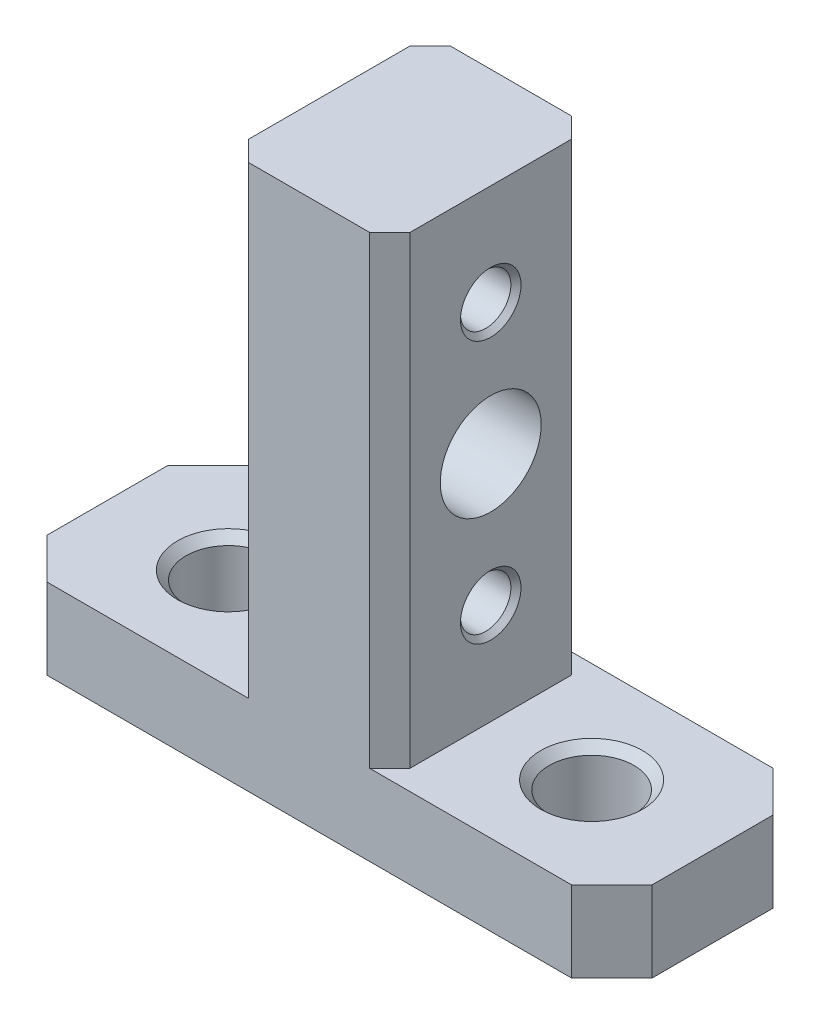
ISO-10303-21;
HEADER;
FILE_DESCRIPTION(('STEP AP214'),'2;1');
FILE_NAME('part.step','',(''),(''),'','','');
FILE_SCHEMA(('AUTOMOTIVE_DESIGN { 1 0 10303 214 1 1 1 1 }'));
ENDSEC;
DATA;
#1=APPLICATION_CONTEXT('core data for automotive mechanical design processes');
#2=APPLICATION_PROTOCOL_DEFINITION('international standard','automotive_design',2000,#1);
#3=PRODUCT_CONTEXT('',#1,'mechanical');
#4=PRODUCT('Part','Part','',(#3));
#5=PRODUCT_RELATED_PRODUCT_CATEGORY('part','',(#4));
#6=PRODUCT_DEFINITION_FORMATION('','',#4);
#7=PRODUCT_DEFINITION_CONTEXT('part definition',#1,'design');
#8=PRODUCT_DEFINITION('design','',#6,#7);
#9=PRODUCT_DEFINITION_SHAPE('','',#8);
#10=(LENGTH_UNIT() NAMED_UNIT(*) SI_UNIT(.MILLI.,.METRE.));
#11=(NAMED_UNIT(*) PLANE_ANGLE_UNIT() SI_UNIT($,.RADIAN.));
#12=(NAMED_UNIT(*) SI_UNIT($,.STERADIAN.) SOLID_ANGLE_UNIT());
#13=UNCERTAINTY_MEASURE_WITH_UNIT(LENGTH_MEASURE(1.E-05),#10,'distance_accuracy_value','');
#14=(GEOMETRIC_REPRESENTATION_CONTEXT(3) GLOBAL_UNCERTAINTY_ASSIGNED_CONTEXT((#13)) GLOBAL_UNIT_ASSIGNED_CONTEXT((#10,
#11,#12)) REPRESENTATION_CONTEXT('',''));
#15=CARTESIAN_POINT('',(0.,0.,0.));
#16=DIRECTION('',(0.,0.,1.));
#17=DIRECTION('',(1.,0.,0.));
#18=AXIS2_PLACEMENT_3D('',#15,#16,#17);
#19=CARTESIAN_POINT('',(-41.5733131157233,-4.03957418193176,10.));
#20=DIRECTION('',(0.,-1.,0.));
#21=DIRECTION('',(0.,0.,-1.));
#22=AXIS2_PLACEMENT_3D('',#19,#20,#21);
#23=PLANE('',#22);
#24=DIRECTION('',(0.,0.,-1.));
#25=VECTOR('',#24,1.);
#26=CARTESIAN_POINT('',(-41.5733131157233,-4.03957418193176,10.));
#27=LINE('',#26,#25);
#28=CARTESIAN_POINT('',(-41.5733131157233,-4.03957418193176,8.));
#29=VERTEX_POINT('',#28);
#30=CARTESIAN_POINT('',(-41.5733131157233,-4.03957418193176,1.99999999999999));
#31=VERTEX_POINT('',#30);
#32=EDGE_CURVE('E159',#29,#31,#27,.T.);
#33=ORIENTED_EDGE('',*,*,#32,.F.);
#34=DIRECTION('',(-0.707106781186546,0.,-0.707106781186549));
#35=VECTOR('',#34,1.);
#36=CARTESIAN_POINT('',(-39.5733131157233,-4.03957418193176,10.));
#37=LINE('',#36,#35);
#38=CARTESIAN_POINT('',(-39.5733131157233,-4.03957418193176,10.));
#39=VERTEX_POINT('',#38);
#40=EDGE_CURVE('E153',#29,#39,#37,.F.);
#41=ORIENTED_EDGE('',*,*,#40,.T.);
#42=DIRECTION('',(-1.,0.,0.));
#43=VECTOR('',#42,1.);
#44=CARTESIAN_POINT('',(-41.5733131157233,-4.03957418193176,10.));
#45=LINE('',#44,#43);
#46=CARTESIAN_POINT('',(-29.5733131157233,-4.03957418193176,10.));
#47=VERTEX_POINT('',#46);
#48=EDGE_CURVE('E156',#47,#39,#45,.T.);
#49=ORIENTED_EDGE('',*,*,#48,.F.);
#50=DIRECTION('',(0.707106781186548,0.,0.707106781186547));
#51=VECTOR('',#50,1.);
#52=CARTESIAN_POINT('',(-35.5733131157233,-4.03957418193176,4.));
#53=LINE('',#52,#51);
#54=CARTESIAN_POINT('',(-30.5733131157233,-4.03957418193176,9.00000000000001));
#55=VERTEX_POINT('',#54);
#56=EDGE_CURVE('E243',#47,#55,#53,.F.);
#57=ORIENTED_EDGE('',*,*,#56,.T.);
#58=DIRECTION('',(0.,0.,-1.));
#59=VECTOR('',#58,1.);
#60=CARTESIAN_POINT('',(-30.5733131157233,-4.03957418193176,10.));
#61=LINE('',#60,#59);
#62=CARTESIAN_POINT('',(-30.5733131157233,-4.03957418193176,1.));
#63=VERTEX_POINT('',#62);
#64=EDGE_CURVE('E248',#55,#63,#61,.T.);
#65=ORIENTED_EDGE('',*,*,#64,.T.);
#66=DIRECTION('',(0.707106781186548,0.,-0.707106781186547));
#67=VECTOR('',#66,1.);
#68=CARTESIAN_POINT('',(-40.5733131157233,-4.03957418193176,11.));
#69=LINE('',#68,#67);
#70=CARTESIAN_POINT('',(-29.5733131157233,-4.03957418193176,0.));
#71=VERTEX_POINT('',#70);
#72=EDGE_CURVE('E49',#63,#71,#69,.T.);
#73=ORIENTED_EDGE('',*,*,#72,.T.);
#74=DIRECTION('',(-1.,0.,0.));
#75=VECTOR('',#74,1.);
#76=CARTESIAN_POINT('',(-41.5733131157233,-4.03957418193176,0.));
#77=LINE('',#76,#75);
#78=CARTESIAN_POINT('',(-39.5733131157233,-4.03957418193176,0.));
#79=VERTEX_POINT('',#78);
#80=EDGE_CURVE('E56',#71,#79,#77,.T.);
#81=ORIENTED_EDGE('',*,*,#80,.T.);
#82=DIRECTION('',(-0.707106781186549,0.,0.707106781186546));
#83=VECTOR('',#82,1.);
#84=CARTESIAN_POINT('',(-41.5733131157233,-4.03957418193176,1.99999999999999));
#85=LINE('',#84,#83);
#86=EDGE_CURVE('E164',#79,#31,#85,.T.);
#87=ORIENTED_EDGE('',*,*,#86,.T.);
#88=EDGE_LOOP('',(#33,#41,#49,#57,#65,#73,#81,#87));
#89=FACE_BOUND('',#88,.T.);
#90=CARTESIAN_POINT('',(-35.5733131157233,-4.03957418193176,5.));
#91=DIRECTION('',(0.,1.,0.));
#92=DIRECTION('',(0.,0.,1.));
#93=AXIS2_PLACEMENT_3D('',#90,#91,#92);
#94=CIRCLE('',#93,2.525);
#95=CARTESIAN_POINT('',(-35.5733131157233,-4.03957418193176,7.525));
#96=VERTEX_POINT('',#95);
#97=EDGE_CURVE('E342',#96,#96,#94,.T.);
#98=ORIENTED_EDGE('',*,*,#97,.F.);
#99=EDGE_LOOP('',(#98));
#100=FACE_BOUND('',#99,.T.);
#101=ADVANCED_FACE('F40',(#89,#100),#23,.F.);
#102=CARTESIAN_POINT('',(-22.5733131157233,-4.03957418193176,10.));
#103=DIRECTION('',(0.,-1.,0.));
#104=DIRECTION('',(0.,0.,-1.));
#105=AXIS2_PLACEMENT_3D('',#102,#103,#104);
#106=PLANE('',#105);
#107=DIRECTION('',(-1.,0.,0.));
#108=VECTOR('',#107,1.);
#109=CARTESIAN_POINT('',(-22.5733131157233,-4.03957418193176,10.));
#110=LINE('',#109,#108);
#111=CARTESIAN_POINT('',(-13.5733131157233,-4.03957418193176,10.));
#112=VERTEX_POINT('',#111);
#113=CARTESIAN_POINT('',(-23.5733131157233,-4.03957418193176,10.));
#114=VERTEX_POINT('',#113);
#115=EDGE_CURVE('E301',#112,#114,#110,.T.);
#116=ORIENTED_EDGE('',*,*,#115,.F.);
#117=DIRECTION('',(-0.707106781186546,0.,0.707106781186549));
#118=VECTOR('',#117,1.);
#119=CARTESIAN_POINT('',(-13.5733131157233,-4.03957418193176,10.));
#120=LINE('',#119,#118);
#121=CARTESIAN_POINT('',(-11.5733131157233,-4.03957418193176,8.));
#122=VERTEX_POINT('',#121);
#123=EDGE_CURVE('E190',#112,#122,#120,.F.);
#124=ORIENTED_EDGE('',*,*,#123,.T.);
#125=DIRECTION('',(0.,0.,-1.));
#126=VECTOR('',#125,1.);
#127=CARTESIAN_POINT('',(-11.5733131157233,-4.03957418193176,10.));
#128=LINE('',#127,#126);
#129=CARTESIAN_POINT('',(-11.5733131157233,-4.03957418193176,2.00000000000001));
#130=VERTEX_POINT('',#129);
#131=EDGE_CURVE('E277',#122,#130,#128,.T.);
#132=ORIENTED_EDGE('',*,*,#131,.T.);
#133=DIRECTION('',(-0.707106781186548,0.,-0.707106781186548));
#134=VECTOR('',#133,1.);
#135=CARTESIAN_POINT('',(-11.5733131157233,-4.03957418193176,2.00000000000001));
#136=LINE('',#135,#134);
#137=CARTESIAN_POINT('',(-13.5733131157233,-4.03957418193176,0.));
#138=VERTEX_POINT('',#137);
#139=EDGE_CURVE('E183',#130,#138,#136,.T.);
#140=ORIENTED_EDGE('',*,*,#139,.T.);
#141=DIRECTION('',(-1.,0.,0.));
#142=VECTOR('',#141,1.);
#143=CARTESIAN_POINT('',(-22.5733131157233,-4.03957418193176,0.));
#144=LINE('',#143,#142);
#145=CARTESIAN_POINT('',(-23.5733131157233,-4.03957418193176,0.));
#146=VERTEX_POINT('',#145);
#147=EDGE_CURVE('E63',#138,#146,#144,.T.);
#148=ORIENTED_EDGE('',*,*,#147,.T.);
#149=DIRECTION('',(0.707106781186549,0.,0.707106781186546));
#150=VECTOR('',#149,1.);
#151=CARTESIAN_POINT('',(-18.0733131157233,-4.03957418193176,5.49999999999999));
#152=LINE('',#151,#150);
#153=CARTESIAN_POINT('',(-22.5733131157233,-4.03957418193176,1.));
#154=VERTEX_POINT('',#153);
#155=EDGE_CURVE('E11',#146,#154,#152,.T.);
#156=ORIENTED_EDGE('',*,*,#155,.T.);
#157=DIRECTION('',(0.,0.,-1.));
#158=VECTOR('',#157,1.);
#159=CARTESIAN_POINT('',(-22.5733131157233,-4.03957418193176,10.));
#160=LINE('',#159,#158);
#161=CARTESIAN_POINT('',(-22.5733131157233,-4.03957418193176,9.));
#162=VERTEX_POINT('',#161);
#163=EDGE_CURVE('E274',#162,#154,#160,.T.);
#164=ORIENTED_EDGE('',*,*,#163,.F.);
#165=DIRECTION('',(0.707106781186548,0.,-0.707106781186548));
#166=VECTOR('',#165,1.);
#167=CARTESIAN_POINT('',(-23.0733131157233,-4.03957418193176,9.5));
#168=LINE('',#167,#166);
#169=EDGE_CURVE('E240',#162,#114,#168,.F.);
#170=ORIENTED_EDGE('',*,*,#169,.T.);
#171=EDGE_LOOP('',(#116,#124,#132,#140,#148,#156,#164,#170));
#172=FACE_BOUND('',#171,.T.);
#173=CARTESIAN_POINT('',(-17.5733131157233,-4.03957418193176,5.));
#174=DIRECTION('',(0.,1.,0.));
#175=DIRECTION('',(0.,0.,1.));
#176=AXIS2_PLACEMENT_3D('',#173,#174,#175);
#177=CIRCLE('',#176,2.525);
#178=CARTESIAN_POINT('',(-17.5733131157233,-4.03957418193176,7.525));
#179=VERTEX_POINT('',#178);
#180=EDGE_CURVE('E333',#179,#179,#177,.T.);
#181=ORIENTED_EDGE('',*,*,#180,.F.);
#182=EDGE_LOOP('',(#181));
#183=FACE_BOUND('',#182,.T.);
#184=ADVANCED_FACE('F348',(#172,#183),#106,.F.);
#185=CARTESIAN_POINT('',(-22.5733131157233,-4.03957418193176,10.));
#186=DIRECTION('',(-1.,0.,0.));
#187=DIRECTION('',(0.,0.,1.));
#188=AXIS2_PLACEMENT_3D('',#185,#186,#187);
#189=PLANE('',#188);
#190=CARTESIAN_POINT('',(-22.5733131157233,7.46042581806824,5.));
#191=DIRECTION('',(1.,0.,0.));
#192=DIRECTION('',(0.,0.,-1.));
#193=AXIS2_PLACEMENT_3D('',#190,#191,#192);
#194=CIRCLE('',#193,2.5);
#195=CARTESIAN_POINT('',(-22.5733131157233,7.46042581806824,2.5));
#196=VERTEX_POINT('',#195);
#197=EDGE_CURVE('E306',#196,#196,#194,.T.);
#198=ORIENTED_EDGE('',*,*,#197,.F.);
#199=EDGE_LOOP('',(#198));
#200=FACE_BOUND('',#199,.T.);
#201=DIRECTION('',(0.,0.,-1.));
#202=VECTOR('',#201,1.);
#203=CARTESIAN_POINT('',(-22.5733131157233,18.9604258180682,10.));
#204=LINE('',#203,#202);
#205=CARTESIAN_POINT('',(-22.5733131157233,18.9604258180682,9.));
#206=VERTEX_POINT('',#205);
#207=CARTESIAN_POINT('',(-22.5733131157233,18.9604258180682,1.));
#208=VERTEX_POINT('',#207);
#209=EDGE_CURVE('E272',#206,#208,#204,.T.);
#210=ORIENTED_EDGE('',*,*,#209,.F.);
#211=DIRECTION('',(0.,-1.,0.));
#212=VECTOR('',#211,1.);
#213=CARTESIAN_POINT('',(-22.5733131157233,-4.03957418193176,9.));
#214=LINE('',#213,#212);
#215=EDGE_CURVE('E229',#206,#162,#214,.T.);
#216=ORIENTED_EDGE('',*,*,#215,.T.);
#217=ORIENTED_EDGE('',*,*,#163,.T.);
#218=DIRECTION('',(0.,1.,0.));
#219=VECTOR('',#218,1.);
#220=CARTESIAN_POINT('',(-22.5733131157233,18.9604258180682,1.));
#221=LINE('',#220,#219);
#222=EDGE_CURVE('E226',#154,#208,#221,.T.);
#223=ORIENTED_EDGE('',*,*,#222,.T.);
#224=EDGE_LOOP('',(#210,#216,#217,#223));
#225=FACE_BOUND('',#224,.T.);
#226=CARTESIAN_POINT('',(-22.5733131157233,0.960425818068242,5.));
#227=DIRECTION('',(1.,0.,0.));
#228=DIRECTION('',(0.,0.,-1.));
#229=AXIS2_PLACEMENT_3D('',#226,#227,#228);
#230=CIRCLE('',#229,1.5);
#231=CARTESIAN_POINT('',(-22.5733131157233,0.960425818068242,3.5));
#232=VERTEX_POINT('',#231);
#233=EDGE_CURVE('E315',#232,#232,#230,.T.);
#234=ORIENTED_EDGE('',*,*,#233,.F.);
#235=EDGE_LOOP('',(#234));
#236=FACE_BOUND('',#235,.T.);
#237=CARTESIAN_POINT('',(-22.5733131157233,13.9604258180682,5.));
#238=DIRECTION('',(1.,0.,0.));
#239=DIRECTION('',(0.,0.,-1.));
#240=AXIS2_PLACEMENT_3D('',#237,#238,#239);
#241=CIRCLE('',#240,1.5);
#242=CARTESIAN_POINT('',(-22.5733131157233,13.9604258180682,3.5));
#243=VERTEX_POINT('',#242);
#244=EDGE_CURVE('E324',#243,#243,#241,.T.);
#245=ORIENTED_EDGE('',*,*,#244,.F.);
#246=EDGE_LOOP('',(#245));
#247=FACE_BOUND('',#246,.T.);
#248=ADVANCED_FACE('F353',(#200,#225,#236,#247),#189,.F.);
#249=CARTESIAN_POINT('',(-41.5733131157233,-4.03957418193176,10.));
#250=DIRECTION('',(1.,0.,0.));
#251=DIRECTION('',(0.,0.,-1.));
#252=AXIS2_PLACEMENT_3D('',#249,#250,#251);
#253=PLANE('',#252);
#254=DIRECTION('',(0.,0.,-1.));
#255=VECTOR('',#254,1.);
#256=CARTESIAN_POINT('',(-41.5733131157233,-8.03957418193176,10.));
#257=LINE('',#256,#255);
#258=CARTESIAN_POINT('',(-41.5733131157233,-8.03957418193176,8.));
#259=VERTEX_POINT('',#258);
#260=CARTESIAN_POINT('',(-41.5733131157233,-8.03957418193176,1.99999999999999));
#261=VERTEX_POINT('',#260);
#262=EDGE_CURVE('E185',#259,#261,#257,.T.);
#263=ORIENTED_EDGE('',*,*,#262,.F.);
#264=DIRECTION('',(0.,1.,0.));
#265=VECTOR('',#264,1.);
#266=CARTESIAN_POINT('',(-41.5733131157233,-4.03957418193176,8.));
#267=LINE('',#266,#265);
#268=EDGE_CURVE('E211',#259,#29,#267,.T.);
#269=ORIENTED_EDGE('',*,*,#268,.T.);
#270=ORIENTED_EDGE('',*,*,#32,.T.);
#271=DIRECTION('',(0.,-1.,0.));
#272=VECTOR('',#271,1.);
#273=CARTESIAN_POINT('',(-41.5733131157233,-8.03957418193176,1.99999999999999));
#274=LINE('',#273,#272);
#275=EDGE_CURVE('E208',#31,#261,#274,.T.);
#276=ORIENTED_EDGE('',*,*,#275,.T.);
#277=EDGE_LOOP('',(#263,#269,#270,#276));
#278=FACE_BOUND('',#277,.T.);
#279=ADVANCED_FACE('F290',(#278),#253,.F.);
#280=CARTESIAN_POINT('',(-41.5733131157233,-8.03957418193176,10.));
#281=DIRECTION('',(0.,1.,0.));
#282=DIRECTION('',(0.,0.,1.));
#283=AXIS2_PLACEMENT_3D('',#280,#281,#282);
#284=PLANE('',#283);
#285=CARTESIAN_POINT('',(-35.5733131157233,-8.03957418193176,5.));
#286=DIRECTION('',(0.,1.,0.));
#287=DIRECTION('',(0.,0.,1.));
#288=AXIS2_PLACEMENT_3D('',#285,#286,#287);
#289=CIRCLE('',#288,2.1);
#290=CARTESIAN_POINT('',(-35.5733131157233,-8.03957418193176,7.1));
#291=VERTEX_POINT('',#290);
#292=EDGE_CURVE('E336',#291,#291,#289,.T.);
#293=ORIENTED_EDGE('',*,*,#292,.T.);
#294=EDGE_LOOP('',(#293));
#295=FACE_BOUND('',#294,.T.);
#296=CARTESIAN_POINT('',(-17.5733131157233,-8.03957418193176,5.));
#297=DIRECTION('',(0.,1.,0.));
#298=DIRECTION('',(0.,0.,1.));
#299=AXIS2_PLACEMENT_3D('',#296,#297,#298);
#300=CIRCLE('',#299,2.1);
#301=CARTESIAN_POINT('',(-17.5733131157233,-8.03957418193176,7.1));
#302=VERTEX_POINT('',#301);
#303=EDGE_CURVE('E327',#302,#302,#300,.T.);
#304=ORIENTED_EDGE('',*,*,#303,.T.);
#305=EDGE_LOOP('',(#304));
#306=FACE_BOUND('',#305,.T.);
#307=DIRECTION('',(0.,0.,-1.));
#308=VECTOR('',#307,1.);
#309=CARTESIAN_POINT('',(-11.5733131157233,-8.03957418193176,10.));
#310=LINE('',#309,#308);
#311=CARTESIAN_POINT('',(-11.5733131157233,-8.03957418193176,8.));
#312=VERTEX_POINT('',#311);
#313=CARTESIAN_POINT('',(-11.5733131157233,-8.03957418193176,2.00000000000001));
#314=VERTEX_POINT('',#313);
#315=EDGE_CURVE('E280',#312,#314,#310,.T.);
#316=ORIENTED_EDGE('',*,*,#315,.F.);
#317=DIRECTION('',(0.707106781186546,0.,-0.707106781186549));
#318=VECTOR('',#317,1.);
#319=CARTESIAN_POINT('',(-13.5733131157233,-8.03957418193176,9.99999999999999));
#320=LINE('',#319,#318);
#321=CARTESIAN_POINT('',(-13.5733131157233,-8.03957418193176,10.));
#322=VERTEX_POINT('',#321);
#323=EDGE_CURVE('E202',#312,#322,#320,.F.);
#324=ORIENTED_EDGE('',*,*,#323,.T.);
#325=DIRECTION('',(1.,0.,0.));
#326=VECTOR('',#325,1.);
#327=CARTESIAN_POINT('',(-41.5733131157233,-8.03957418193176,10.));
#328=LINE('',#327,#326);
#329=CARTESIAN_POINT('',(-39.5733131157233,-8.03957418193176,10.));
#330=VERTEX_POINT('',#329);
#331=EDGE_CURVE('E175',#330,#322,#328,.T.);
#332=ORIENTED_EDGE('',*,*,#331,.F.);
#333=DIRECTION('',(0.707106781186546,0.,0.707106781186549));
#334=VECTOR('',#333,1.);
#335=CARTESIAN_POINT('',(-39.5733131157233,-8.03957418193176,10.));
#336=LINE('',#335,#334);
#337=EDGE_CURVE('E179',#330,#259,#336,.F.);
#338=ORIENTED_EDGE('',*,*,#337,.T.);
#339=ORIENTED_EDGE('',*,*,#262,.T.);
#340=DIRECTION('',(0.707106781186549,0.,-0.707106781186546));
#341=VECTOR('',#340,1.);
#342=CARTESIAN_POINT('',(-41.5733131157233,-8.03957418193176,1.99999999999999));
#343=LINE('',#342,#341);
#344=CARTESIAN_POINT('',(-39.5733131157233,-8.03957418193176,0.));
#345=VERTEX_POINT('',#344);
#346=EDGE_CURVE('E197',#261,#345,#343,.T.);
#347=ORIENTED_EDGE('',*,*,#346,.T.);
#348=DIRECTION('',(1.,0.,0.));
#349=VECTOR('',#348,1.);
#350=CARTESIAN_POINT('',(-41.5733131157233,-8.03957418193176,0.));
#351=LINE('',#350,#349);
#352=CARTESIAN_POINT('',(-13.5733131157233,-8.03957418193176,0.));
#353=VERTEX_POINT('',#352);
#354=EDGE_CURVE('E264',#345,#353,#351,.T.);
#355=ORIENTED_EDGE('',*,*,#354,.T.);
#356=DIRECTION('',(0.707106781186548,0.,0.707106781186548));
#357=VECTOR('',#356,1.);
#358=CARTESIAN_POINT('',(-11.5733131157233,-8.03957418193176,2.00000000000001));
#359=LINE('',#358,#357);
#360=EDGE_CURVE('E200',#353,#314,#359,.T.);
#361=ORIENTED_EDGE('',*,*,#360,.T.);
#362=EDGE_LOOP('',(#316,#324,#332,#338,#339,#347,#355,#361));
#363=FACE_BOUND('',#362,.T.);
#364=ADVANCED_FACE('F286',(#295,#306,#363),#284,.F.);
#365=CARTESIAN_POINT('',(-11.5733131157233,-8.03957418193176,10.));
#366=DIRECTION('',(-1.,0.,0.));
#367=DIRECTION('',(0.,-1.,0.));
#368=AXIS2_PLACEMENT_3D('',#365,#366,#367);
#369=PLANE('',#368);
#370=ORIENTED_EDGE('',*,*,#131,.F.);
#371=DIRECTION('',(0.,-1.,0.));
#372=VECTOR('',#371,1.);
#373=CARTESIAN_POINT('',(-11.5733131157233,-8.03957418193176,8.));
#374=LINE('',#373,#372);
#375=EDGE_CURVE('E195',#122,#312,#374,.T.);
#376=ORIENTED_EDGE('',*,*,#375,.T.);
#377=ORIENTED_EDGE('',*,*,#315,.T.);
#378=DIRECTION('',(0.,1.,0.));
#379=VECTOR('',#378,1.);
#380=CARTESIAN_POINT('',(-11.5733131157233,-4.03957418193176,2.00000000000001));
#381=LINE('',#380,#379);
#382=EDGE_CURVE('E192',#314,#130,#381,.T.);
#383=ORIENTED_EDGE('',*,*,#382,.T.);
#384=EDGE_LOOP('',(#370,#376,#377,#383));
#385=FACE_BOUND('',#384,.T.);
#386=ADVANCED_FACE('F426',(#385),#369,.F.);
#387=CARTESIAN_POINT('',(-22.5733131157233,18.9604258180682,10.));
#388=DIRECTION('',(0.,-1.,0.));
#389=DIRECTION('',(0.,0.,-1.));
#390=AXIS2_PLACEMENT_3D('',#387,#388,#389);
#391=PLANE('',#390);
#392=DIRECTION('',(-1.,0.,0.));
#393=VECTOR('',#392,1.);
#394=CARTESIAN_POINT('',(-22.5733131157233,18.9604258180682,10.));
#395=LINE('',#394,#393);
#396=CARTESIAN_POINT('',(-23.5733131157233,18.9604258180682,10.));
#397=VERTEX_POINT('',#396);
#398=CARTESIAN_POINT('',(-29.5733131157233,18.9604258180682,10.));
#399=VERTEX_POINT('',#398);
#400=EDGE_CURVE('E270',#397,#399,#395,.T.);
#401=ORIENTED_EDGE('',*,*,#400,.F.);
#402=DIRECTION('',(-0.707106781186548,0.,0.707106781186548));
#403=VECTOR('',#402,1.);
#404=CARTESIAN_POINT('',(-23.5733131157233,18.9604258180682,10.));
#405=LINE('',#404,#403);
#406=EDGE_CURVE('E224',#397,#206,#405,.F.);
#407=ORIENTED_EDGE('',*,*,#406,.T.);
#408=ORIENTED_EDGE('',*,*,#209,.T.);
#409=DIRECTION('',(-0.707106781186549,0.,-0.707106781186546));
#410=VECTOR('',#409,1.);
#411=CARTESIAN_POINT('',(-22.5733131157233,18.9604258180682,1.));
#412=LINE('',#411,#410);
#413=CARTESIAN_POINT('',(-23.5733131157233,18.9604258180682,0.));
#414=VERTEX_POINT('',#413);
#415=EDGE_CURVE('E218',#208,#414,#412,.T.);
#416=ORIENTED_EDGE('',*,*,#415,.T.);
#417=DIRECTION('',(-1.,0.,0.));
#418=VECTOR('',#417,1.);
#419=CARTESIAN_POINT('',(-22.5733131157233,18.9604258180682,0.));
#420=LINE('',#419,#418);
#421=CARTESIAN_POINT('',(-29.5733131157233,18.9604258180682,0.));
#422=VERTEX_POINT('',#421);
#423=EDGE_CURVE('E176',#414,#422,#420,.T.);
#424=ORIENTED_EDGE('',*,*,#423,.T.);
#425=DIRECTION('',(-0.707106781186548,0.,0.707106781186547));
#426=VECTOR('',#425,1.);
#427=CARTESIAN_POINT('',(-30.5733131157233,18.9604258180682,1.));
#428=LINE('',#427,#426);
#429=CARTESIAN_POINT('',(-30.5733131157233,18.9604258180682,1.));
#430=VERTEX_POINT('',#429);
#431=EDGE_CURVE('E220',#422,#430,#428,.T.);
#432=ORIENTED_EDGE('',*,*,#431,.T.);
#433=DIRECTION('',(0.,0.,-1.));
#434=VECTOR('',#433,1.);
#435=CARTESIAN_POINT('',(-30.5733131157233,18.9604258180682,10.));
#436=LINE('',#435,#434);
#437=CARTESIAN_POINT('',(-30.5733131157233,18.9604258180682,9.00000000000001));
#438=VERTEX_POINT('',#437);
#439=EDGE_CURVE('E269',#438,#430,#436,.T.);
#440=ORIENTED_EDGE('',*,*,#439,.F.);
#441=DIRECTION('',(-0.707106781186548,0.,-0.707106781186547));
#442=VECTOR('',#441,1.);
#443=CARTESIAN_POINT('',(-29.5733131157233,18.9604258180682,10.));
#444=LINE('',#443,#442);
#445=EDGE_CURVE('E222',#438,#399,#444,.F.);
#446=ORIENTED_EDGE('',*,*,#445,.T.);
#447=EDGE_LOOP('',(#401,#407,#408,#416,#424,#432,#440,#446));
#448=FACE_BOUND('',#447,.T.);
#449=ADVANCED_FACE('F259',(#448),#391,.F.);
#450=CARTESIAN_POINT('',(-30.5733131157233,18.9604258180682,10.));
#451=DIRECTION('',(1.,0.,0.));
#452=DIRECTION('',(0.,1.,0.));
#453=AXIS2_PLACEMENT_3D('',#450,#451,#452);
#454=PLANE('',#453);
#455=CARTESIAN_POINT('',(-30.5733131157233,13.9604258180682,5.));
#456=DIRECTION('',(1.,0.,0.));
#457=DIRECTION('',(0.,1.,0.));
#458=AXIS2_PLACEMENT_3D('',#455,#456,#457);
#459=CIRCLE('',#458,1.25);
#460=CARTESIAN_POINT('',(-30.5733131157233,15.2104258180682,5.));
#461=VERTEX_POINT('',#460);
#462=EDGE_CURVE('E318',#461,#461,#459,.T.);
#463=ORIENTED_EDGE('',*,*,#462,.T.);
#464=EDGE_LOOP('',(#463));
#465=FACE_BOUND('',#464,.T.);
#466=CARTESIAN_POINT('',(-30.5733131157233,0.960425818068242,5.));
#467=DIRECTION('',(1.,0.,0.));
#468=DIRECTION('',(0.,1.,0.));
#469=AXIS2_PLACEMENT_3D('',#466,#467,#468);
#470=CIRCLE('',#469,1.25);
#471=CARTESIAN_POINT('',(-30.5733131157233,2.21042581806824,5.));
#472=VERTEX_POINT('',#471);
#473=EDGE_CURVE('E309',#472,#472,#470,.T.);
#474=ORIENTED_EDGE('',*,*,#473,.T.);
#475=EDGE_LOOP('',(#474));
#476=FACE_BOUND('',#475,.T.);
#477=CARTESIAN_POINT('',(-30.5733131157233,7.46042581806824,5.));
#478=DIRECTION('',(1.,0.,0.));
#479=DIRECTION('',(0.,1.,0.));
#480=AXIS2_PLACEMENT_3D('',#477,#478,#479);
#481=CIRCLE('',#480,2.5);
#482=CARTESIAN_POINT('',(-30.5733131157233,9.96042581806824,5.));
#483=VERTEX_POINT('',#482);
#484=EDGE_CURVE('E297',#483,#483,#481,.F.);
#485=ORIENTED_EDGE('',*,*,#484,.F.);
#486=EDGE_LOOP('',(#485));
#487=FACE_BOUND('',#486,.T.);
#488=ORIENTED_EDGE('',*,*,#64,.F.);
#489=DIRECTION('',(0.,1.,0.));
#490=VECTOR('',#489,1.);
#491=CARTESIAN_POINT('',(-30.5733131157233,18.9604258180682,9.00000000000001));
#492=LINE('',#491,#490);
#493=EDGE_CURVE('E234',#55,#438,#492,.T.);
#494=ORIENTED_EDGE('',*,*,#493,.T.);
#495=ORIENTED_EDGE('',*,*,#439,.T.);
#496=DIRECTION('',(0.,-1.,0.));
#497=VECTOR('',#496,1.);
#498=CARTESIAN_POINT('',(-30.5733131157233,-4.03957418193176,1.));
#499=LINE('',#498,#497);
#500=EDGE_CURVE('E231',#430,#63,#499,.T.);
#501=ORIENTED_EDGE('',*,*,#500,.T.);
#502=EDGE_LOOP('',(#488,#494,#495,#501));
#503=FACE_BOUND('',#502,.T.);
#504=ADVANCED_FACE('F434',(#465,#476,#487,#503),#454,.F.);
#505=CARTESIAN_POINT('',(0.,0.,10.));
#506=DIRECTION('',(0.,0.,-1.));
#507=DIRECTION('',(-1.,0.,0.));
#508=AXIS2_PLACEMENT_3D('',#505,#506,#507);
#509=PLANE('',#508);
#510=ORIENTED_EDGE('',*,*,#115,.T.);
#511=DIRECTION('',(0.,1.,0.));
#512=VECTOR('',#511,1.);
#513=CARTESIAN_POINT('',(-23.5733131157233,0.,10.));
#514=LINE('',#513,#512);
#515=EDGE_CURVE('E215',#114,#397,#514,.T.);
#516=ORIENTED_EDGE('',*,*,#515,.T.);
#517=ORIENTED_EDGE('',*,*,#400,.T.);
#518=DIRECTION('',(0.,-1.,0.));
#519=VECTOR('',#518,1.);
#520=CARTESIAN_POINT('',(-29.5733131157233,0.,10.));
#521=LINE('',#520,#519);
#522=EDGE_CURVE('E163',#399,#47,#521,.T.);
#523=ORIENTED_EDGE('',*,*,#522,.T.);
#524=ORIENTED_EDGE('',*,*,#48,.T.);
#525=DIRECTION('',(0.,-1.,0.));
#526=VECTOR('',#525,1.);
#527=CARTESIAN_POINT('',(-39.5733131157233,0.,10.));
#528=LINE('',#527,#526);
#529=EDGE_CURVE('E171',#39,#330,#528,.T.);
#530=ORIENTED_EDGE('',*,*,#529,.T.);
#531=ORIENTED_EDGE('',*,*,#331,.T.);
#532=DIRECTION('',(0.,1.,0.));
#533=VECTOR('',#532,1.);
#534=CARTESIAN_POINT('',(-13.5733131157233,0.,10.));
#535=LINE('',#534,#533);
#536=EDGE_CURVE('E180',#322,#112,#535,.T.);
#537=ORIENTED_EDGE('',*,*,#536,.T.);
#538=EDGE_LOOP('',(#510,#516,#517,#523,#524,#530,#531,#537));
#539=FACE_BOUND('',#538,.T.);
#540=ADVANCED_FACE('F169',(#539),#509,.F.);
#541=CARTESIAN_POINT('',(0.,0.,0.));
#542=DIRECTION('',(0.,0.,-1.));
#543=DIRECTION('',(-1.,0.,0.));
#544=AXIS2_PLACEMENT_3D('',#541,#542,#543);
#545=PLANE('',#544);
#546=ORIENTED_EDGE('',*,*,#80,.F.);
#547=DIRECTION('',(0.,1.,0.));
#548=VECTOR('',#547,1.);
#549=CARTESIAN_POINT('',(-29.5733131157233,18.9604258180682,0.));
#550=LINE('',#549,#548);
#551=EDGE_CURVE('E238',#71,#422,#550,.T.);
#552=ORIENTED_EDGE('',*,*,#551,.T.);
#553=ORIENTED_EDGE('',*,*,#423,.F.);
#554=DIRECTION('',(0.,-1.,0.));
#555=VECTOR('',#554,1.);
#556=CARTESIAN_POINT('',(-23.5733131157233,-4.03957418193176,0.));
#557=LINE('',#556,#555);
#558=EDGE_CURVE('E236',#414,#146,#557,.T.);
#559=ORIENTED_EDGE('',*,*,#558,.T.);
#560=ORIENTED_EDGE('',*,*,#147,.F.);
#561=DIRECTION('',(0.,-1.,0.));
#562=VECTOR('',#561,1.);
#563=CARTESIAN_POINT('',(-13.5733131157233,-8.03957418193175,0.));
#564=LINE('',#563,#562);
#565=EDGE_CURVE('E206',#138,#353,#564,.T.);
#566=ORIENTED_EDGE('',*,*,#565,.T.);
#567=ORIENTED_EDGE('',*,*,#354,.F.);
#568=DIRECTION('',(0.,1.,0.));
#569=VECTOR('',#568,1.);
#570=CARTESIAN_POINT('',(-39.5733131157233,-4.03957418193176,0.));
#571=LINE('',#570,#569);
#572=EDGE_CURVE('E204',#345,#79,#571,.T.);
#573=ORIENTED_EDGE('',*,*,#572,.T.);
#574=EDGE_LOOP('',(#546,#552,#553,#559,#560,#566,#567,#573));
#575=FACE_BOUND('',#574,.T.);
#576=ADVANCED_FACE('F255',(#575),#545,.T.);
#577=CARTESIAN_POINT('',(-13.5733131157233,0.,10.));
#578=DIRECTION('',(-0.707106781186549,0.,-0.707106781186546));
#579=DIRECTION('',(0.,1.,0.));
#580=AXIS2_PLACEMENT_3D('',#577,#578,#579);
#581=PLANE('',#580);
#582=ORIENTED_EDGE('',*,*,#323,.F.);
#583=ORIENTED_EDGE('',*,*,#375,.F.);
#584=ORIENTED_EDGE('',*,*,#123,.F.);
#585=ORIENTED_EDGE('',*,*,#536,.F.);
#586=EDGE_LOOP('',(#582,#583,#584,#585));
#587=FACE_BOUND('',#586,.T.);
#588=ADVANCED_FACE('F359',(#587),#581,.F.);
#589=CARTESIAN_POINT('',(-11.5733131157233,-8.03957418193176,2.00000000000001));
#590=DIRECTION('',(0.707106781186548,0.,-0.707106781186548));
#591=DIRECTION('',(0.,-1.,0.));
#592=AXIS2_PLACEMENT_3D('',#589,#590,#591);
#593=PLANE('',#592);
#594=ORIENTED_EDGE('',*,*,#360,.F.);
#595=ORIENTED_EDGE('',*,*,#565,.F.);
#596=ORIENTED_EDGE('',*,*,#139,.F.);
#597=ORIENTED_EDGE('',*,*,#382,.F.);
#598=EDGE_LOOP('',(#594,#595,#596,#597));
#599=FACE_BOUND('',#598,.T.);
#600=ADVANCED_FACE('F365',(#599),#593,.T.);
#601=CARTESIAN_POINT('',(-39.5733131157233,0.,10.));
#602=DIRECTION('',(0.707106781186549,0.,-0.707106781186546));
#603=DIRECTION('',(0.,-1.,0.));
#604=AXIS2_PLACEMENT_3D('',#601,#602,#603);
#605=PLANE('',#604);
#606=ORIENTED_EDGE('',*,*,#40,.F.);
#607=ORIENTED_EDGE('',*,*,#268,.F.);
#608=ORIENTED_EDGE('',*,*,#337,.F.);
#609=ORIENTED_EDGE('',*,*,#529,.F.);
#610=EDGE_LOOP('',(#606,#607,#608,#609));
#611=FACE_BOUND('',#610,.T.);
#612=ADVANCED_FACE('F178',(#611),#605,.F.);
#613=CARTESIAN_POINT('',(-41.5733131157233,-4.03957418193176,1.99999999999999));
#614=DIRECTION('',(-0.707106781186546,0.,-0.707106781186549));
#615=DIRECTION('',(0.,1.,0.));
#616=AXIS2_PLACEMENT_3D('',#613,#614,#615);
#617=PLANE('',#616);
#618=ORIENTED_EDGE('',*,*,#86,.F.);
#619=ORIENTED_EDGE('',*,*,#572,.F.);
#620=ORIENTED_EDGE('',*,*,#346,.F.);
#621=ORIENTED_EDGE('',*,*,#275,.F.);
#622=EDGE_LOOP('',(#618,#619,#620,#621));
#623=FACE_BOUND('',#622,.T.);
#624=ADVANCED_FACE('F293',(#623),#617,.T.);
#625=CARTESIAN_POINT('',(-23.5733131157233,0.,10.));
#626=DIRECTION('',(-0.707106781186547,0.,-0.707106781186547));
#627=DIRECTION('',(0.,1.,0.));
#628=AXIS2_PLACEMENT_3D('',#625,#626,#627);
#629=PLANE('',#628);
#630=ORIENTED_EDGE('',*,*,#169,.F.);
#631=ORIENTED_EDGE('',*,*,#215,.F.);
#632=ORIENTED_EDGE('',*,*,#406,.F.);
#633=ORIENTED_EDGE('',*,*,#515,.F.);
#634=EDGE_LOOP('',(#630,#631,#632,#633));
#635=FACE_BOUND('',#634,.T.);
#636=ADVANCED_FACE('F383',(#635),#629,.F.);
#637=CARTESIAN_POINT('',(-29.5733131157233,0.,10.));
#638=DIRECTION('',(0.707106781186547,0.,-0.707106781186548));
#639=DIRECTION('',(0.,-1.,0.));
#640=AXIS2_PLACEMENT_3D('',#637,#638,#639);
#641=PLANE('',#640);
#642=ORIENTED_EDGE('',*,*,#445,.F.);
#643=ORIENTED_EDGE('',*,*,#493,.F.);
#644=ORIENTED_EDGE('',*,*,#56,.F.);
#645=ORIENTED_EDGE('',*,*,#522,.F.);
#646=EDGE_LOOP('',(#642,#643,#644,#645));
#647=FACE_BOUND('',#646,.T.);
#648=ADVANCED_FACE('F389',(#647),#641,.F.);
#649=CARTESIAN_POINT('',(-30.5733131157233,18.9604258180682,1.));
#650=DIRECTION('',(-0.707106781186547,0.,-0.707106781186548));
#651=DIRECTION('',(0.,1.,0.));
#652=AXIS2_PLACEMENT_3D('',#649,#650,#651);
#653=PLANE('',#652);
#654=ORIENTED_EDGE('',*,*,#431,.F.);
#655=ORIENTED_EDGE('',*,*,#551,.F.);
#656=ORIENTED_EDGE('',*,*,#72,.F.);
#657=ORIENTED_EDGE('',*,*,#500,.F.);
#658=EDGE_LOOP('',(#654,#655,#656,#657));
#659=FACE_BOUND('',#658,.T.);
#660=ADVANCED_FACE('F252',(#659),#653,.T.);
#661=CARTESIAN_POINT('',(-22.5733131157233,-4.03957418193176,1.));
#662=DIRECTION('',(0.707106781186546,0.,-0.707106781186549));
#663=DIRECTION('',(0.,-1.,0.));
#664=AXIS2_PLACEMENT_3D('',#661,#662,#663);
#665=PLANE('',#664);
#666=ORIENTED_EDGE('',*,*,#155,.F.);
#667=ORIENTED_EDGE('',*,*,#558,.F.);
#668=ORIENTED_EDGE('',*,*,#415,.F.);
#669=ORIENTED_EDGE('',*,*,#222,.F.);
#670=EDGE_LOOP('',(#666,#667,#668,#669));
#671=FACE_BOUND('',#670,.T.);
#672=ADVANCED_FACE('F43',(#671),#665,.T.);
#673=CARTESIAN_POINT('',(-41.5743131157233,7.46042581806824,5.));
#674=DIRECTION('',(1.,0.,0.));
#675=DIRECTION('',(0.,0.,-1.));
#676=AXIS2_PLACEMENT_3D('',#673,#674,#675);
#677=CYLINDRICAL_SURFACE('',#676,2.5);
#678=ORIENTED_EDGE('',*,*,#197,.T.);
#679=EDGE_LOOP('',(#678));
#680=FACE_BOUND('',#679,.T.);
#681=ORIENTED_EDGE('',*,*,#484,.T.);
#682=EDGE_LOOP('',(#681));
#683=FACE_BOUND('',#682,.T.);
#684=ADVANCED_FACE('F402',(#680,#683),#677,.F.);
#685=CARTESIAN_POINT('',(-22.5733131157233,0.960425818068242,5.));
#686=DIRECTION('',(1.,0.,0.));
#687=DIRECTION('',(0.,0.,-1.));
#688=AXIS2_PLACEMENT_3D('',#685,#686,#687);
#689=CYLINDRICAL_SURFACE('',#688,1.25);
#690=ORIENTED_EDGE('',*,*,#473,.F.);
#691=EDGE_LOOP('',(#690));
#692=FACE_BOUND('',#691,.T.);
#693=CARTESIAN_POINT('',(-22.8233131157233,0.960425818068242,5.));
#694=DIRECTION('',(1.,0.,0.));
#695=DIRECTION('',(0.,0.,-1.));
#696=AXIS2_PLACEMENT_3D('',#693,#694,#695);
#697=CIRCLE('',#696,1.25);
#698=CARTESIAN_POINT('',(-22.8233131157233,0.960425818068242,3.75));
#699=VERTEX_POINT('',#698);
#700=EDGE_CURVE('E312',#699,#699,#697,.T.);
#701=ORIENTED_EDGE('',*,*,#700,.T.);
#702=EDGE_LOOP('',(#701));
#703=FACE_BOUND('',#702,.T.);
#704=ADVANCED_FACE('F407',(#692,#703),#689,.F.);
#705=CARTESIAN_POINT('',(-22.5733131157233,0.960425818068242,5.));
#706=DIRECTION('',(1.,0.,0.));
#707=DIRECTION('',(0.,0.,-1.));
#708=AXIS2_PLACEMENT_3D('',#705,#706,#707);
#709=CONICAL_SURFACE('',#708,1.5,0.785398163397443);
#710=ORIENTED_EDGE('',*,*,#700,.F.);
#711=EDGE_LOOP('',(#710));
#712=FACE_BOUND('',#711,.T.);
#713=ORIENTED_EDGE('',*,*,#233,.T.);
#714=EDGE_LOOP('',(#713));
#715=FACE_BOUND('',#714,.T.);
#716=ADVANCED_FACE('F450',(#712,#715),#709,.F.);
#717=CARTESIAN_POINT('',(-22.5733131157233,13.9604258180682,5.));
#718=DIRECTION('',(1.,0.,0.));
#719=DIRECTION('',(0.,0.,-1.));
#720=AXIS2_PLACEMENT_3D('',#717,#718,#719);
#721=CYLINDRICAL_SURFACE('',#720,1.25);
#722=ORIENTED_EDGE('',*,*,#462,.F.);
#723=EDGE_LOOP('',(#722));
#724=FACE_BOUND('',#723,.T.);
#725=CARTESIAN_POINT('',(-22.8233131157233,13.9604258180682,5.));
#726=DIRECTION('',(1.,0.,0.));
#727=DIRECTION('',(0.,0.,-1.));
#728=AXIS2_PLACEMENT_3D('',#725,#726,#727);
#729=CIRCLE('',#728,1.25);
#730=CARTESIAN_POINT('',(-22.8233131157233,13.9604258180682,3.75));
#731=VERTEX_POINT('',#730);
#732=EDGE_CURVE('E321',#731,#731,#729,.T.);
#733=ORIENTED_EDGE('',*,*,#732,.T.);
#734=EDGE_LOOP('',(#733));
#735=FACE_BOUND('',#734,.T.);
#736=ADVANCED_FACE('F454',(#724,#735),#721,.F.);
#737=CARTESIAN_POINT('',(-22.5733131157233,13.9604258180682,5.));
#738=DIRECTION('',(1.,0.,0.));
#739=DIRECTION('',(0.,0.,-1.));
#740=AXIS2_PLACEMENT_3D('',#737,#738,#739);
#741=CONICAL_SURFACE('',#740,1.5,0.785398163397442);
#742=ORIENTED_EDGE('',*,*,#732,.F.);
#743=EDGE_LOOP('',(#742));
#744=FACE_BOUND('',#743,.T.);
#745=ORIENTED_EDGE('',*,*,#244,.T.);
#746=EDGE_LOOP('',(#745));
#747=FACE_BOUND('',#746,.T.);
#748=ADVANCED_FACE('F458',(#744,#747),#741,.F.);
#749=CARTESIAN_POINT('',(-17.5733131157233,-4.03957418193176,5.));
#750=DIRECTION('',(0.,1.,0.));
#751=DIRECTION('',(0.,0.,1.));
#752=AXIS2_PLACEMENT_3D('',#749,#750,#751);
#753=CYLINDRICAL_SURFACE('',#752,2.1);
#754=ORIENTED_EDGE('',*,*,#303,.F.);
#755=EDGE_LOOP('',(#754));
#756=FACE_BOUND('',#755,.T.);
#757=CARTESIAN_POINT('',(-17.5733131157233,-4.46457418193176,5.));
#758=DIRECTION('',(0.,1.,0.));
#759=DIRECTION('',(0.,0.,1.));
#760=AXIS2_PLACEMENT_3D('',#757,#758,#759);
#761=CIRCLE('',#760,2.1);
#762=CARTESIAN_POINT('',(-17.5733131157233,-4.46457418193176,7.1));
#763=VERTEX_POINT('',#762);
#764=EDGE_CURVE('E330',#763,#763,#761,.T.);
#765=ORIENTED_EDGE('',*,*,#764,.T.);
#766=EDGE_LOOP('',(#765));
#767=FACE_BOUND('',#766,.T.);
#768=ADVANCED_FACE('F462',(#756,#767),#753,.F.);
#769=CARTESIAN_POINT('',(-17.5733131157233,-4.03957418193176,5.));
#770=DIRECTION('',(0.,1.,0.));
#771=DIRECTION('',(0.,0.,1.));
#772=AXIS2_PLACEMENT_3D('',#769,#770,#771);
#773=CONICAL_SURFACE('',#772,2.525,0.785398163397449);
#774=ORIENTED_EDGE('',*,*,#764,.F.);
#775=EDGE_LOOP('',(#774));
#776=FACE_BOUND('',#775,.T.);
#777=ORIENTED_EDGE('',*,*,#180,.T.);
#778=EDGE_LOOP('',(#777));
#779=FACE_BOUND('',#778,.T.);
#780=ADVANCED_FACE('F466',(#776,#779),#773,.F.);
#781=CARTESIAN_POINT('',(-35.5733131157233,-4.03957418193176,5.));
#782=DIRECTION('',(0.,1.,0.));
#783=DIRECTION('',(0.,0.,1.));
#784=AXIS2_PLACEMENT_3D('',#781,#782,#783);
#785=CYLINDRICAL_SURFACE('',#784,2.1);
#786=ORIENTED_EDGE('',*,*,#292,.F.);
#787=EDGE_LOOP('',(#786));
#788=FACE_BOUND('',#787,.T.);
#789=CARTESIAN_POINT('',(-35.5733131157233,-4.46457418193176,5.));
#790=DIRECTION('',(0.,1.,0.));
#791=DIRECTION('',(0.,0.,1.));
#792=AXIS2_PLACEMENT_3D('',#789,#790,#791);
#793=CIRCLE('',#792,2.1);
#794=CARTESIAN_POINT('',(-35.5733131157233,-4.46457418193176,7.1));
#795=VERTEX_POINT('',#794);
#796=EDGE_CURVE('E339',#795,#795,#793,.T.);
#797=ORIENTED_EDGE('',*,*,#796,.T.);
#798=EDGE_LOOP('',(#797));
#799=FACE_BOUND('',#798,.T.);
#800=ADVANCED_FACE('F470',(#788,#799),#785,.F.);
#801=CARTESIAN_POINT('',(-35.5733131157233,-4.03957418193176,5.));
#802=DIRECTION('',(0.,1.,0.));
#803=DIRECTION('',(0.,0.,1.));
#804=AXIS2_PLACEMENT_3D('',#801,#802,#803);
#805=CONICAL_SURFACE('',#804,2.525,0.785398163397451);
#806=ORIENTED_EDGE('',*,*,#796,.F.);
#807=EDGE_LOOP('',(#806));
#808=FACE_BOUND('',#807,.T.);
#809=ORIENTED_EDGE('',*,*,#97,.T.);
#810=EDGE_LOOP('',(#809));
#811=FACE_BOUND('',#810,.T.);
#812=ADVANCED_FACE('F346',(#808,#811),#805,.F.);
#813=CLOSED_SHELL('',(#101,#184,#248,#279,#364,#386,#449,#504,#540,#576,#588,#600,#612,#624,
#636,#648,#660,#672,#684,#704,#716,#736,#748,#768,#780,#800,#812));
#814=MANIFOLD_SOLID_BREP('B2',#813);
#815=ADVANCED_BREP_SHAPE_REPRESENTATION('',(#18,#814),#14);
#816=SHAPE_DEFINITION_REPRESENTATION(#9,#815);
ENDSEC;
END-ISO-10303-21;
